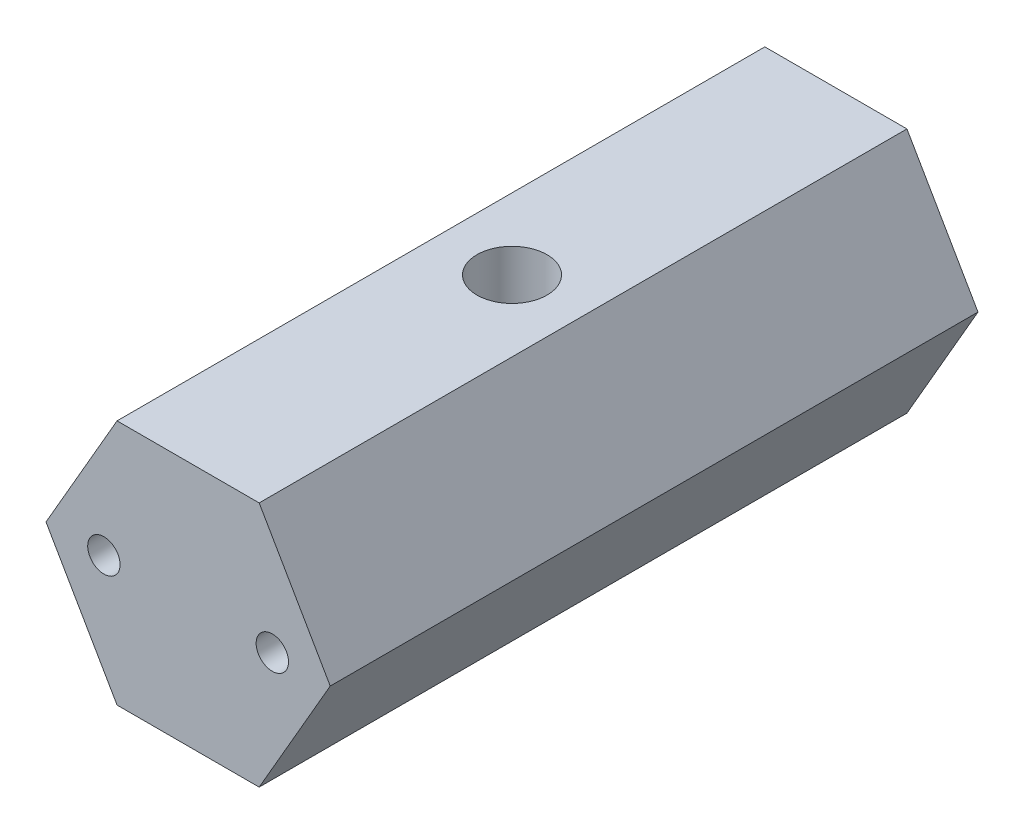
ISO-10303-21;
HEADER;
FILE_DESCRIPTION(('STEP AP214'),'2;1');
FILE_NAME('part.step','',(''),(''),'','','');
FILE_SCHEMA(('AUTOMOTIVE_DESIGN { 1 0 10303 214 1 1 1 1 }'));
ENDSEC;
DATA;
#1=APPLICATION_CONTEXT('core data for automotive mechanical design processes');
#2=APPLICATION_PROTOCOL_DEFINITION('international standard','automotive_design',2000,#1);
#3=PRODUCT_CONTEXT('',#1,'mechanical');
#4=PRODUCT('Part','Part','',(#3));
#5=PRODUCT_RELATED_PRODUCT_CATEGORY('part','',(#4));
#6=PRODUCT_DEFINITION_FORMATION('','',#4);
#7=PRODUCT_DEFINITION_CONTEXT('part definition',#1,'design');
#8=PRODUCT_DEFINITION('design','',#6,#7);
#9=PRODUCT_DEFINITION_SHAPE('','',#8);
#10=(LENGTH_UNIT() NAMED_UNIT(*) SI_UNIT(.MILLI.,.METRE.));
#11=(NAMED_UNIT(*) PLANE_ANGLE_UNIT() SI_UNIT($,.RADIAN.));
#12=(NAMED_UNIT(*) SI_UNIT($,.STERADIAN.) SOLID_ANGLE_UNIT());
#13=UNCERTAINTY_MEASURE_WITH_UNIT(LENGTH_MEASURE(1.E-05),#10,'distance_accuracy_value','');
#14=(GEOMETRIC_REPRESENTATION_CONTEXT(3) GLOBAL_UNCERTAINTY_ASSIGNED_CONTEXT((#13)) GLOBAL_UNIT_ASSIGNED_CONTEXT((#10,
#11,#12)) REPRESENTATION_CONTEXT('',''));
#15=CARTESIAN_POINT('',(0.,0.,0.));
#16=DIRECTION('',(0.,0.,1.));
#17=DIRECTION('',(1.,0.,0.));
#18=AXIS2_PLACEMENT_3D('',#15,#16,#17);
#19=CARTESIAN_POINT('',(5.48482755730145,9.5,25.));
#20=DIRECTION('',(0.,-1.,0.));
#21=DIRECTION('',(1.,0.,0.));
#22=AXIS2_PLACEMENT_3D('',#19,#20,#21);
#23=PLANE('',#22);
#24=DIRECTION('',(-1.,0.,0.));
#25=VECTOR('',#24,1.);
#26=CARTESIAN_POINT('',(5.48482755730145,9.5,-25.));
#27=LINE('',#26,#25);
#28=CARTESIAN_POINT('',(5.48482755730145,9.5,-25.));
#29=VERTEX_POINT('',#28);
#30=CARTESIAN_POINT('',(-5.48482755730144,9.5,-25.));
#31=VERTEX_POINT('',#30);
#32=EDGE_CURVE('E89',#29,#31,#27,.T.);
#33=ORIENTED_EDGE('',*,*,#32,.T.);
#34=DIRECTION('',(0.,0.,-1.));
#35=VECTOR('',#34,1.);
#36=CARTESIAN_POINT('',(-5.48482755730144,9.5,25.));
#37=LINE('',#36,#35);
#38=CARTESIAN_POINT('',(-5.48482755730144,9.5,25.));
#39=VERTEX_POINT('',#38);
#40=EDGE_CURVE('E127',#39,#31,#37,.T.);
#41=ORIENTED_EDGE('',*,*,#40,.F.);
#42=DIRECTION('',(-1.,0.,0.));
#43=VECTOR('',#42,1.);
#44=CARTESIAN_POINT('',(5.48482755730145,9.5,25.));
#45=LINE('',#44,#43);
#46=CARTESIAN_POINT('',(5.48482755730145,9.5,25.));
#47=VERTEX_POINT('',#46);
#48=EDGE_CURVE('E115',#47,#39,#45,.T.);
#49=ORIENTED_EDGE('',*,*,#48,.F.);
#50=DIRECTION('',(0.,0.,-1.));
#51=VECTOR('',#50,1.);
#52=CARTESIAN_POINT('',(5.48482755730145,9.5,25.));
#53=LINE('',#52,#51);
#54=EDGE_CURVE('E122',#47,#29,#53,.T.);
#55=ORIENTED_EDGE('',*,*,#54,.T.);
#56=EDGE_LOOP('',(#33,#41,#49,#55));
#57=FACE_BOUND('',#56,.T.);
#58=CARTESIAN_POINT('',(0.,9.5,0.));
#59=DIRECTION('',(0.,1.,0.));
#60=DIRECTION('',(0.,0.,1.));
#61=AXIS2_PLACEMENT_3D('',#58,#59,#60);
#62=CIRCLE('',#61,2.70509999999999);
#63=CARTESIAN_POINT('',(0.,9.5,2.70509999999999));
#64=VERTEX_POINT('',#63);
#65=EDGE_CURVE('E195',#64,#64,#62,.T.);
#66=ORIENTED_EDGE('',*,*,#65,.F.);
#67=EDGE_LOOP('',(#66));
#68=FACE_BOUND('',#67,.T.);
#69=ADVANCED_FACE('F49',(#57,#68),#23,.F.);
#70=CARTESIAN_POINT('',(0.,0.,25.));
#71=DIRECTION('',(0.,0.,1.));
#72=DIRECTION('',(1.,0.,0.));
#73=AXIS2_PLACEMENT_3D('',#70,#71,#72);
#74=PLANE('',#73);
#75=CARTESIAN_POINT('',(-6.5,0.,25.));
#76=DIRECTION('',(0.,0.,1.));
#77=DIRECTION('',(1.,0.,0.));
#78=AXIS2_PLACEMENT_3D('',#75,#76,#77);
#79=CIRCLE('',#78,1.25);
#80=CARTESIAN_POINT('',(-5.25,0.,25.));
#81=VERTEX_POINT('',#80);
#82=EDGE_CURVE('E139',#81,#81,#79,.T.);
#83=ORIENTED_EDGE('',*,*,#82,.F.);
#84=EDGE_LOOP('',(#83));
#85=FACE_BOUND('',#84,.T.);
#86=DIRECTION('',(0.5,-0.866025403784438,0.));
#87=VECTOR('',#86,1.);
#88=CARTESIAN_POINT('',(-10.9696551146029,0.,25.));
#89=LINE('',#88,#87);
#90=CARTESIAN_POINT('',(-10.9696551146029,0.,25.));
#91=VERTEX_POINT('',#90);
#92=CARTESIAN_POINT('',(-5.48482755730144,-9.5,25.));
#93=VERTEX_POINT('',#92);
#94=EDGE_CURVE('E146',#91,#93,#89,.T.);
#95=ORIENTED_EDGE('',*,*,#94,.T.);
#96=DIRECTION('',(1.,0.,0.));
#97=VECTOR('',#96,1.);
#98=CARTESIAN_POINT('',(-5.48482755730144,-9.5,25.));
#99=LINE('',#98,#97);
#100=CARTESIAN_POINT('',(5.48482755730145,-9.5,25.));
#101=VERTEX_POINT('',#100);
#102=EDGE_CURVE('E103',#93,#101,#99,.T.);
#103=ORIENTED_EDGE('',*,*,#102,.T.);
#104=DIRECTION('',(0.5,0.866025403784439,0.));
#105=VECTOR('',#104,1.);
#106=CARTESIAN_POINT('',(5.48482755730145,-9.5,25.));
#107=LINE('',#106,#105);
#108=CARTESIAN_POINT('',(10.9696551146029,0.,25.));
#109=VERTEX_POINT('',#108);
#110=EDGE_CURVE('E117',#101,#109,#107,.T.);
#111=ORIENTED_EDGE('',*,*,#110,.T.);
#112=DIRECTION('',(-0.5,0.866025403784439,0.));
#113=VECTOR('',#112,1.);
#114=CARTESIAN_POINT('',(10.9696551146029,0.,25.));
#115=LINE('',#114,#113);
#116=EDGE_CURVE('E110',#109,#47,#115,.T.);
#117=ORIENTED_EDGE('',*,*,#116,.T.);
#118=ORIENTED_EDGE('',*,*,#48,.T.);
#119=DIRECTION('',(-0.5,-0.866025403784439,0.));
#120=VECTOR('',#119,1.);
#121=CARTESIAN_POINT('',(-5.48482755730144,9.5,25.));
#122=LINE('',#121,#120);
#123=EDGE_CURVE('E66',#39,#91,#122,.T.);
#124=ORIENTED_EDGE('',*,*,#123,.T.);
#125=EDGE_LOOP('',(#95,#103,#111,#117,#118,#124));
#126=FACE_BOUND('',#125,.T.);
#127=CARTESIAN_POINT('',(6.5,0.,25.));
#128=DIRECTION('',(0.,0.,1.));
#129=DIRECTION('',(1.,0.,0.));
#130=AXIS2_PLACEMENT_3D('',#127,#128,#129);
#131=CIRCLE('',#130,1.25);
#132=CARTESIAN_POINT('',(7.75,0.,25.));
#133=VERTEX_POINT('',#132);
#134=EDGE_CURVE('E198',#133,#133,#131,.T.);
#135=ORIENTED_EDGE('',*,*,#134,.F.);
#136=EDGE_LOOP('',(#135));
#137=FACE_BOUND('',#136,.T.);
#138=ADVANCED_FACE('F112',(#85,#126,#137),#74,.T.);
#139=CARTESIAN_POINT('',(0.,0.,-25.));
#140=DIRECTION('',(0.,0.,1.));
#141=DIRECTION('',(1.,0.,0.));
#142=AXIS2_PLACEMENT_3D('',#139,#140,#141);
#143=PLANE('',#142);
#144=DIRECTION('',(0.5,-0.866025403784438,0.));
#145=VECTOR('',#144,1.);
#146=CARTESIAN_POINT('',(-10.9696551146029,0.,-25.));
#147=LINE('',#146,#145);
#148=CARTESIAN_POINT('',(-10.9696551146029,0.,-25.));
#149=VERTEX_POINT('',#148);
#150=CARTESIAN_POINT('',(-5.48482755730144,-9.5,-25.));
#151=VERTEX_POINT('',#150);
#152=EDGE_CURVE('E135',#149,#151,#147,.T.);
#153=ORIENTED_EDGE('',*,*,#152,.F.);
#154=DIRECTION('',(-0.5,-0.866025403784439,0.));
#155=VECTOR('',#154,1.);
#156=CARTESIAN_POINT('',(-5.48482755730144,9.5,-25.));
#157=LINE('',#156,#155);
#158=EDGE_CURVE('E95',#31,#149,#157,.T.);
#159=ORIENTED_EDGE('',*,*,#158,.F.);
#160=ORIENTED_EDGE('',*,*,#32,.F.);
#161=DIRECTION('',(-0.5,0.866025403784439,0.));
#162=VECTOR('',#161,1.);
#163=CARTESIAN_POINT('',(10.9696551146029,0.,-25.));
#164=LINE('',#163,#162);
#165=CARTESIAN_POINT('',(10.9696551146029,0.,-25.));
#166=VERTEX_POINT('',#165);
#167=EDGE_CURVE('E125',#166,#29,#164,.T.);
#168=ORIENTED_EDGE('',*,*,#167,.F.);
#169=DIRECTION('',(0.5,0.866025403784439,0.));
#170=VECTOR('',#169,1.);
#171=CARTESIAN_POINT('',(5.48482755730145,-9.5,-25.));
#172=LINE('',#171,#170);
#173=CARTESIAN_POINT('',(5.48482755730145,-9.5,-25.));
#174=VERTEX_POINT('',#173);
#175=EDGE_CURVE('E141',#174,#166,#172,.T.);
#176=ORIENTED_EDGE('',*,*,#175,.F.);
#177=DIRECTION('',(1.,0.,0.));
#178=VECTOR('',#177,1.);
#179=CARTESIAN_POINT('',(-5.48482755730144,-9.5,-25.));
#180=LINE('',#179,#178);
#181=EDGE_CURVE('E138',#151,#174,#180,.T.);
#182=ORIENTED_EDGE('',*,*,#181,.F.);
#183=EDGE_LOOP('',(#153,#159,#160,#168,#176,#182));
#184=FACE_BOUND('',#183,.T.);
#185=CARTESIAN_POINT('',(-6.5,0.,-25.));
#186=DIRECTION('',(0.,0.,1.));
#187=DIRECTION('',(1.,0.,0.));
#188=AXIS2_PLACEMENT_3D('',#185,#186,#187);
#189=CIRCLE('',#188,1.25);
#190=CARTESIAN_POINT('',(-5.25,0.,-25.));
#191=VERTEX_POINT('',#190);
#192=EDGE_CURVE('E204',#191,#191,#189,.T.);
#193=ORIENTED_EDGE('',*,*,#192,.T.);
#194=EDGE_LOOP('',(#193));
#195=FACE_BOUND('',#194,.T.);
#196=CARTESIAN_POINT('',(6.5,0.,-25.));
#197=DIRECTION('',(0.,0.,1.));
#198=DIRECTION('',(1.,0.,0.));
#199=AXIS2_PLACEMENT_3D('',#196,#197,#198);
#200=CIRCLE('',#199,1.25);
#201=CARTESIAN_POINT('',(7.75,0.,-25.));
#202=VERTEX_POINT('',#201);
#203=EDGE_CURVE('E194',#202,#202,#200,.T.);
#204=ORIENTED_EDGE('',*,*,#203,.T.);
#205=EDGE_LOOP('',(#204));
#206=FACE_BOUND('',#205,.T.);
#207=ADVANCED_FACE('F155',(#184,#195,#206),#143,.F.);
#208=CARTESIAN_POINT('',(-10.9696551146029,0.,25.));
#209=DIRECTION('',(0.866025403784438,0.5,0.));
#210=DIRECTION('',(-0.5,0.866025403784439,0.));
#211=AXIS2_PLACEMENT_3D('',#208,#209,#210);
#212=PLANE('',#211);
#213=ORIENTED_EDGE('',*,*,#152,.T.);
#214=DIRECTION('',(0.,0.,-1.));
#215=VECTOR('',#214,1.);
#216=CARTESIAN_POINT('',(-5.48482755730144,-9.5,25.));
#217=LINE('',#216,#215);
#218=EDGE_CURVE('E11',#93,#151,#217,.T.);
#219=ORIENTED_EDGE('',*,*,#218,.F.);
#220=ORIENTED_EDGE('',*,*,#94,.F.);
#221=DIRECTION('',(0.,0.,-1.));
#222=VECTOR('',#221,1.);
#223=CARTESIAN_POINT('',(-10.9696551146029,0.,25.));
#224=LINE('',#223,#222);
#225=EDGE_CURVE('E131',#91,#149,#224,.T.);
#226=ORIENTED_EDGE('',*,*,#225,.T.);
#227=EDGE_LOOP('',(#213,#219,#220,#226));
#228=FACE_BOUND('',#227,.T.);
#229=ADVANCED_FACE('F51',(#228),#212,.F.);
#230=CARTESIAN_POINT('',(-5.48482755730144,-9.5,25.));
#231=DIRECTION('',(0.,1.,0.));
#232=DIRECTION('',(-1.,0.,0.));
#233=AXIS2_PLACEMENT_3D('',#230,#231,#232);
#234=PLANE('',#233);
#235=CARTESIAN_POINT('',(0.,-9.5,0.));
#236=DIRECTION('',(0.,1.,0.));
#237=DIRECTION('',(-1.,0.,0.));
#238=AXIS2_PLACEMENT_3D('',#235,#236,#237);
#239=CIRCLE('',#238,2.70509999999999);
#240=CARTESIAN_POINT('',(-2.70509999999999,-9.5,0.));
#241=VERTEX_POINT('',#240);
#242=EDGE_CURVE('E192',#241,#241,#239,.T.);
#243=ORIENTED_EDGE('',*,*,#242,.T.);
#244=EDGE_LOOP('',(#243));
#245=FACE_BOUND('',#244,.T.);
#246=ORIENTED_EDGE('',*,*,#181,.T.);
#247=DIRECTION('',(0.,0.,-1.));
#248=VECTOR('',#247,1.);
#249=CARTESIAN_POINT('',(5.48482755730145,-9.5,25.));
#250=LINE('',#249,#248);
#251=EDGE_CURVE('E58',#101,#174,#250,.T.);
#252=ORIENTED_EDGE('',*,*,#251,.F.);
#253=ORIENTED_EDGE('',*,*,#102,.F.);
#254=ORIENTED_EDGE('',*,*,#218,.T.);
#255=EDGE_LOOP('',(#246,#252,#253,#254));
#256=FACE_BOUND('',#255,.T.);
#257=ADVANCED_FACE('F183',(#245,#256),#234,.F.);
#258=CARTESIAN_POINT('',(5.48482755730145,-9.5,25.));
#259=DIRECTION('',(-0.866025403784439,0.5,0.));
#260=DIRECTION('',(-0.5,-0.866025403784439,0.));
#261=AXIS2_PLACEMENT_3D('',#258,#259,#260);
#262=PLANE('',#261);
#263=ORIENTED_EDGE('',*,*,#175,.T.);
#264=DIRECTION('',(0.,0.,-1.));
#265=VECTOR('',#264,1.);
#266=CARTESIAN_POINT('',(10.9696551146029,0.,25.));
#267=LINE('',#266,#265);
#268=EDGE_CURVE('E126',#109,#166,#267,.T.);
#269=ORIENTED_EDGE('',*,*,#268,.F.);
#270=ORIENTED_EDGE('',*,*,#110,.F.);
#271=ORIENTED_EDGE('',*,*,#251,.T.);
#272=EDGE_LOOP('',(#263,#269,#270,#271));
#273=FACE_BOUND('',#272,.T.);
#274=ADVANCED_FACE('F152',(#273),#262,.F.);
#275=CARTESIAN_POINT('',(10.9696551146029,0.,25.));
#276=DIRECTION('',(-0.866025403784439,-0.5,0.));
#277=DIRECTION('',(0.5,-0.866025403784439,0.));
#278=AXIS2_PLACEMENT_3D('',#275,#276,#277);
#279=PLANE('',#278);
#280=ORIENTED_EDGE('',*,*,#167,.T.);
#281=ORIENTED_EDGE('',*,*,#54,.F.);
#282=ORIENTED_EDGE('',*,*,#116,.F.);
#283=ORIENTED_EDGE('',*,*,#268,.T.);
#284=EDGE_LOOP('',(#280,#281,#282,#283));
#285=FACE_BOUND('',#284,.T.);
#286=ADVANCED_FACE('F123',(#285),#279,.F.);
#287=CARTESIAN_POINT('',(-5.48482755730144,9.5,25.));
#288=DIRECTION('',(0.866025403784439,-0.5,0.));
#289=DIRECTION('',(0.5,0.866025403784439,0.));
#290=AXIS2_PLACEMENT_3D('',#287,#288,#289);
#291=PLANE('',#290);
#292=ORIENTED_EDGE('',*,*,#158,.T.);
#293=ORIENTED_EDGE('',*,*,#225,.F.);
#294=ORIENTED_EDGE('',*,*,#123,.F.);
#295=ORIENTED_EDGE('',*,*,#40,.T.);
#296=EDGE_LOOP('',(#292,#293,#294,#295));
#297=FACE_BOUND('',#296,.T.);
#298=ADVANCED_FACE('F160',(#297),#291,.F.);
#299=CARTESIAN_POINT('',(-6.5,0.,25.));
#300=DIRECTION('',(0.,0.,-1.));
#301=DIRECTION('',(-1.,0.,0.));
#302=AXIS2_PLACEMENT_3D('',#299,#300,#301);
#303=CYLINDRICAL_SURFACE('',#302,1.25);
#304=ORIENTED_EDGE('',*,*,#82,.T.);
#305=EDGE_LOOP('',(#304));
#306=FACE_BOUND('',#305,.T.);
#307=ORIENTED_EDGE('',*,*,#192,.F.);
#308=EDGE_LOOP('',(#307));
#309=FACE_BOUND('',#308,.T.);
#310=ADVANCED_FACE('F162',(#306,#309),#303,.F.);
#311=CARTESIAN_POINT('',(6.5,0.,25.));
#312=DIRECTION('',(0.,0.,-1.));
#313=DIRECTION('',(-1.,0.,0.));
#314=AXIS2_PLACEMENT_3D('',#311,#312,#313);
#315=CYLINDRICAL_SURFACE('',#314,1.25);
#316=ORIENTED_EDGE('',*,*,#134,.T.);
#317=EDGE_LOOP('',(#316));
#318=FACE_BOUND('',#317,.T.);
#319=ORIENTED_EDGE('',*,*,#203,.F.);
#320=EDGE_LOOP('',(#319));
#321=FACE_BOUND('',#320,.T.);
#322=ADVANCED_FACE('F168',(#318,#321),#315,.F.);
#323=CARTESIAN_POINT('',(0.,9.5,0.));
#324=DIRECTION('',(0.,1.,0.));
#325=DIRECTION('',(0.,0.,1.));
#326=AXIS2_PLACEMENT_3D('',#323,#324,#325);
#327=CYLINDRICAL_SURFACE('',#326,2.70509999999999);
#328=ORIENTED_EDGE('',*,*,#242,.F.);
#329=EDGE_LOOP('',(#328));
#330=FACE_BOUND('',#329,.T.);
#331=ORIENTED_EDGE('',*,*,#65,.T.);
#332=EDGE_LOOP('',(#331));
#333=FACE_BOUND('',#332,.T.);
#334=ADVANCED_FACE('F218',(#330,#333),#327,.F.);
#335=CLOSED_SHELL('',(#69,#138,#207,#229,#257,#274,#286,#298,#310,#322,#334));
#336=MANIFOLD_SOLID_BREP('B2',#335);
#337=ADVANCED_BREP_SHAPE_REPRESENTATION('',(#18,#336),#14);
#338=SHAPE_DEFINITION_REPRESENTATION(#9,#337);
ENDSEC;
END-ISO-10303-21;
